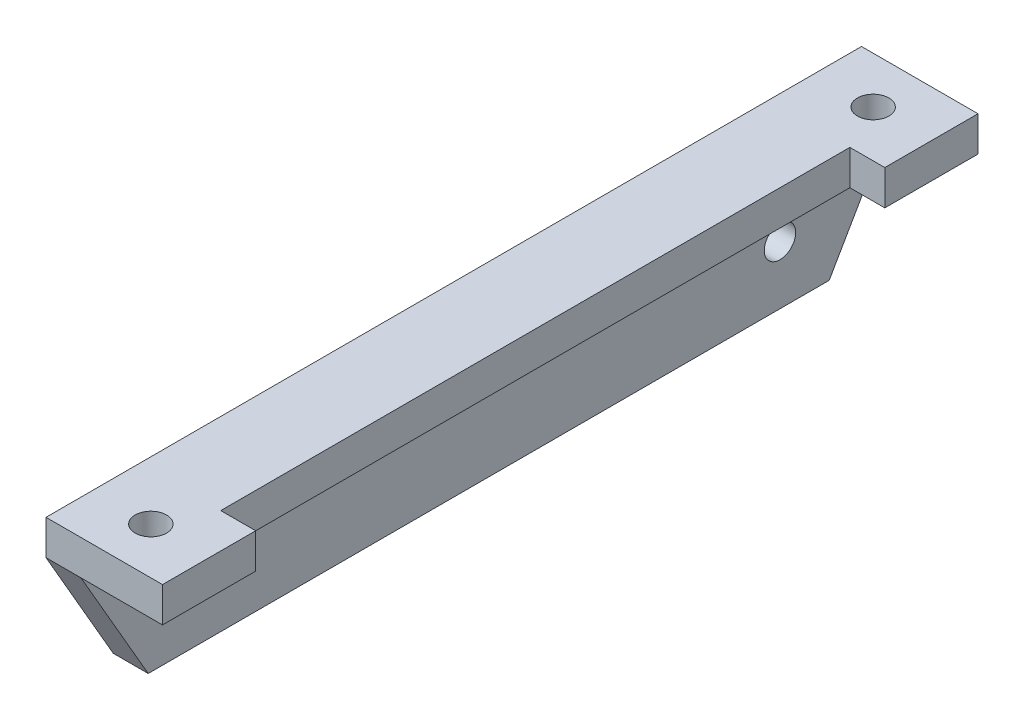
ISO-10303-21;
HEADER;
FILE_DESCRIPTION(('STEP AP214'),'2;1');
FILE_NAME('part.step','',(''),(''),'','','');
FILE_SCHEMA(('AUTOMOTIVE_DESIGN { 1 0 10303 214 1 1 1 1 }'));
ENDSEC;
DATA;
#1=APPLICATION_CONTEXT('core data for automotive mechanical design processes');
#2=APPLICATION_PROTOCOL_DEFINITION('international standard','automotive_design',2000,#1);
#3=PRODUCT_CONTEXT('',#1,'mechanical');
#4=PRODUCT('Part','Part','',(#3));
#5=PRODUCT_RELATED_PRODUCT_CATEGORY('part','',(#4));
#6=PRODUCT_DEFINITION_FORMATION('','',#4);
#7=PRODUCT_DEFINITION_CONTEXT('part definition',#1,'design');
#8=PRODUCT_DEFINITION('design','',#6,#7);
#9=PRODUCT_DEFINITION_SHAPE('','',#8);
#10=(LENGTH_UNIT() NAMED_UNIT(*) SI_UNIT(.MILLI.,.METRE.));
#11=(NAMED_UNIT(*) PLANE_ANGLE_UNIT() SI_UNIT($,.RADIAN.));
#12=(NAMED_UNIT(*) SI_UNIT($,.STERADIAN.) SOLID_ANGLE_UNIT());
#13=UNCERTAINTY_MEASURE_WITH_UNIT(LENGTH_MEASURE(1.E-05),#10,'distance_accuracy_value','');
#14=(GEOMETRIC_REPRESENTATION_CONTEXT(3) GLOBAL_UNCERTAINTY_ASSIGNED_CONTEXT((#13)) GLOBAL_UNIT_ASSIGNED_CONTEXT((#10,
#11,#12)) REPRESENTATION_CONTEXT('',''));
#15=CARTESIAN_POINT('',(0.,0.,0.));
#16=DIRECTION('',(0.,0.,1.));
#17=DIRECTION('',(1.,0.,0.));
#18=AXIS2_PLACEMENT_3D('',#15,#16,#17);
#19=CARTESIAN_POINT('',(10.,3.,35.));
#20=DIRECTION('',(-1.,0.,0.));
#21=DIRECTION('',(0.,0.,1.));
#22=AXIS2_PLACEMENT_3D('',#19,#20,#21);
#23=PLANE('',#22);
#24=DIRECTION('',(0.,0.,-1.));
#25=VECTOR('',#24,1.);
#26=CARTESIAN_POINT('',(10.,0.,35.));
#27=LINE('',#26,#25);
#28=CARTESIAN_POINT('',(10.,0.,35.));
#29=VERTEX_POINT('',#28);
#30=CARTESIAN_POINT('',(10.,0.,27.));
#31=VERTEX_POINT('',#30);
#32=EDGE_CURVE('E163',#29,#31,#27,.T.);
#33=ORIENTED_EDGE('',*,*,#32,.T.);
#34=DIRECTION('',(0.,1.,0.));
#35=VECTOR('',#34,1.);
#36=CARTESIAN_POINT('',(10.,-7.,27.));
#37=LINE('',#36,#35);
#38=CARTESIAN_POINT('',(10.,3.,27.));
#39=VERTEX_POINT('',#38);
#40=EDGE_CURVE('E259',#31,#39,#37,.T.);
#41=ORIENTED_EDGE('',*,*,#40,.T.);
#42=DIRECTION('',(0.,0.,-1.));
#43=VECTOR('',#42,1.);
#44=CARTESIAN_POINT('',(10.,3.,35.));
#45=LINE('',#44,#43);
#46=CARTESIAN_POINT('',(10.,3.,35.));
#47=VERTEX_POINT('',#46);
#48=EDGE_CURVE('E149',#47,#39,#45,.T.);
#49=ORIENTED_EDGE('',*,*,#48,.F.);
#50=DIRECTION('',(0.,-1.,0.));
#51=VECTOR('',#50,1.);
#52=CARTESIAN_POINT('',(10.,3.,35.));
#53=LINE('',#52,#51);
#54=EDGE_CURVE('E172',#47,#29,#53,.T.);
#55=ORIENTED_EDGE('',*,*,#54,.T.);
#56=EDGE_LOOP('',(#33,#41,#49,#55));
#57=FACE_BOUND('',#56,.T.);
#58=ADVANCED_FACE('F43',(#57),#23,.F.);
#59=CARTESIAN_POINT('',(0.,3.,35.));
#60=DIRECTION('',(1.,0.,0.));
#61=DIRECTION('',(0.,0.,-1.));
#62=AXIS2_PLACEMENT_3D('',#59,#60,#61);
#63=PLANE('',#62);
#64=CARTESIAN_POINT('',(0.,-5.,-25.));
#65=DIRECTION('',(1.,0.,0.));
#66=DIRECTION('',(0.,0.,-1.));
#67=AXIS2_PLACEMENT_3D('',#64,#65,#66);
#68=CIRCLE('',#67,1.35);
#69=CARTESIAN_POINT('',(0.,-5.,-26.35));
#70=VERTEX_POINT('',#69);
#71=EDGE_CURVE('E182',#70,#70,#68,.T.);
#72=ORIENTED_EDGE('',*,*,#71,.T.);
#73=EDGE_LOOP('',(#72));
#74=FACE_BOUND('',#73,.T.);
#75=CARTESIAN_POINT('',(0.,-5.,25.));
#76=DIRECTION('',(1.,0.,0.));
#77=DIRECTION('',(0.,0.,-1.));
#78=AXIS2_PLACEMENT_3D('',#75,#76,#77);
#79=CIRCLE('',#78,1.35);
#80=CARTESIAN_POINT('',(0.,-5.,23.65));
#81=VERTEX_POINT('',#80);
#82=EDGE_CURVE('E252',#81,#81,#79,.T.);
#83=ORIENTED_EDGE('',*,*,#82,.T.);
#84=EDGE_LOOP('',(#83));
#85=FACE_BOUND('',#84,.T.);
#86=DIRECTION('',(0.,-1.,0.));
#87=VECTOR('',#86,1.);
#88=CARTESIAN_POINT('',(0.,3.,-35.));
#89=LINE('',#88,#87);
#90=CARTESIAN_POINT('',(0.,3.,-35.));
#91=VERTEX_POINT('',#90);
#92=CARTESIAN_POINT('',(0.,0.,-35.));
#93=VERTEX_POINT('',#92);
#94=EDGE_CURVE('E158',#91,#93,#89,.T.);
#95=ORIENTED_EDGE('',*,*,#94,.T.);
#96=DIRECTION('',(0.,-0.86602540378444,0.499999999999998));
#97=VECTOR('',#96,1.);
#98=CARTESIAN_POINT('',(0.,-10.,-29.2264973081037));
#99=LINE('',#98,#97);
#100=CARTESIAN_POINT('',(0.,-10.,-29.2264973081037));
#101=VERTEX_POINT('',#100);
#102=EDGE_CURVE('E199',#93,#101,#99,.T.);
#103=ORIENTED_EDGE('',*,*,#102,.T.);
#104=DIRECTION('',(0.,0.,-1.));
#105=VECTOR('',#104,1.);
#106=CARTESIAN_POINT('',(0.,-10.,35.));
#107=LINE('',#106,#105);
#108=CARTESIAN_POINT('',(0.,-10.,29.2264973081037));
#109=VERTEX_POINT('',#108);
#110=EDGE_CURVE('E239',#109,#101,#107,.T.);
#111=ORIENTED_EDGE('',*,*,#110,.F.);
#112=DIRECTION('',(0.,0.86602540378444,0.499999999999998));
#113=VECTOR('',#112,1.);
#114=CARTESIAN_POINT('',(0.,-10.,29.2264973081037));
#115=LINE('',#114,#113);
#116=CARTESIAN_POINT('',(0.,0.,35.));
#117=VERTEX_POINT('',#116);
#118=EDGE_CURVE('E66',#109,#117,#115,.T.);
#119=ORIENTED_EDGE('',*,*,#118,.T.);
#120=DIRECTION('',(0.,-1.,0.));
#121=VECTOR('',#120,1.);
#122=CARTESIAN_POINT('',(0.,3.,35.));
#123=LINE('',#122,#121);
#124=CARTESIAN_POINT('',(0.,3.,35.));
#125=VERTEX_POINT('',#124);
#126=EDGE_CURVE('E175',#125,#117,#123,.T.);
#127=ORIENTED_EDGE('',*,*,#126,.F.);
#128=DIRECTION('',(0.,0.,1.));
#129=VECTOR('',#128,1.);
#130=CARTESIAN_POINT('',(0.,3.,35.));
#131=LINE('',#130,#129);
#132=EDGE_CURVE('E153',#91,#125,#131,.T.);
#133=ORIENTED_EDGE('',*,*,#132,.F.);
#134=EDGE_LOOP('',(#95,#103,#111,#119,#127,#133));
#135=FACE_BOUND('',#134,.T.);
#136=ADVANCED_FACE('F221',(#74,#85,#135),#63,.F.);
#137=CARTESIAN_POINT('',(0.,3.,35.));
#138=DIRECTION('',(0.,0.,-1.));
#139=DIRECTION('',(-1.,0.,0.));
#140=AXIS2_PLACEMENT_3D('',#137,#138,#139);
#141=PLANE('',#140);
#142=ORIENTED_EDGE('',*,*,#126,.T.);
#143=DIRECTION('',(1.,0.,0.));
#144=VECTOR('',#143,1.);
#145=CARTESIAN_POINT('',(3.,0.,35.));
#146=LINE('',#145,#144);
#147=CARTESIAN_POINT('',(3.,0.,35.));
#148=VERTEX_POINT('',#147);
#149=EDGE_CURVE('E201',#117,#148,#146,.T.);
#150=ORIENTED_EDGE('',*,*,#149,.T.);
#151=DIRECTION('',(1.,0.,0.));
#152=VECTOR('',#151,1.);
#153=CARTESIAN_POINT('',(0.,0.,35.));
#154=LINE('',#153,#152);
#155=EDGE_CURVE('E159',#148,#29,#154,.T.);
#156=ORIENTED_EDGE('',*,*,#155,.T.);
#157=ORIENTED_EDGE('',*,*,#54,.F.);
#158=DIRECTION('',(1.,0.,0.));
#159=VECTOR('',#158,1.);
#160=CARTESIAN_POINT('',(0.,3.,35.));
#161=LINE('',#160,#159);
#162=EDGE_CURVE('E150',#125,#47,#161,.T.);
#163=ORIENTED_EDGE('',*,*,#162,.F.);
#164=EDGE_LOOP('',(#142,#150,#156,#157,#163));
#165=FACE_BOUND('',#164,.T.);
#166=ADVANCED_FACE('F224',(#165),#141,.F.);
#167=CARTESIAN_POINT('',(10.,3.,-27.));
#168=VERTEX_POINT('',#167);
#169=CARTESIAN_POINT('',(9.99999999999999,3.,-35.));
#170=VERTEX_POINT('',#169);
#171=EDGE_CURVE('E139',#168,#170,#45,.T.);
#172=ORIENTED_EDGE('',*,*,#171,.F.);
#173=DIRECTION('',(0.,1.,0.));
#174=VECTOR('',#173,1.);
#175=CARTESIAN_POINT('',(10.,-7.,-27.));
#176=LINE('',#175,#174);
#177=CARTESIAN_POINT('',(10.,0.,-27.));
#178=VERTEX_POINT('',#177);
#179=EDGE_CURVE('E124',#178,#168,#176,.T.);
#180=ORIENTED_EDGE('',*,*,#179,.F.);
#181=CARTESIAN_POINT('',(9.99999999999999,0.,-35.));
#182=VERTEX_POINT('',#181);
#183=EDGE_CURVE('E161',#178,#182,#27,.T.);
#184=ORIENTED_EDGE('',*,*,#183,.T.);
#185=DIRECTION('',(0.,-1.,0.));
#186=VECTOR('',#185,1.);
#187=CARTESIAN_POINT('',(9.99999999999999,3.,-35.));
#188=LINE('',#187,#186);
#189=EDGE_CURVE('E147',#170,#182,#188,.T.);
#190=ORIENTED_EDGE('',*,*,#189,.F.);
#191=EDGE_LOOP('',(#172,#180,#184,#190));
#192=FACE_BOUND('',#191,.T.);
#193=ADVANCED_FACE('F145',(#192),#23,.F.);
#194=CARTESIAN_POINT('',(0.,3.,-35.));
#195=DIRECTION('',(0.,0.,1.));
#196=DIRECTION('',(1.,0.,0.));
#197=AXIS2_PLACEMENT_3D('',#194,#195,#196);
#198=PLANE('',#197);
#199=DIRECTION('',(-1.,0.,0.));
#200=VECTOR('',#199,1.);
#201=CARTESIAN_POINT('',(0.,0.,-35.));
#202=LINE('',#201,#200);
#203=CARTESIAN_POINT('',(3.,0.,-35.));
#204=VERTEX_POINT('',#203);
#205=EDGE_CURVE('E166',#182,#204,#202,.T.);
#206=ORIENTED_EDGE('',*,*,#205,.T.);
#207=DIRECTION('',(-1.,0.,0.));
#208=VECTOR('',#207,1.);
#209=CARTESIAN_POINT('',(0.,0.,-35.));
#210=LINE('',#209,#208);
#211=EDGE_CURVE('E196',#204,#93,#210,.T.);
#212=ORIENTED_EDGE('',*,*,#211,.T.);
#213=ORIENTED_EDGE('',*,*,#94,.F.);
#214=DIRECTION('',(-1.,0.,0.));
#215=VECTOR('',#214,1.);
#216=CARTESIAN_POINT('',(0.,3.,-35.));
#217=LINE('',#216,#215);
#218=EDGE_CURVE('E152',#170,#91,#217,.T.);
#219=ORIENTED_EDGE('',*,*,#218,.F.);
#220=ORIENTED_EDGE('',*,*,#189,.T.);
#221=EDGE_LOOP('',(#206,#212,#213,#219,#220));
#222=FACE_BOUND('',#221,.T.);
#223=ADVANCED_FACE('F215',(#222),#198,.F.);
#224=CARTESIAN_POINT('',(0.,3.,0.));
#225=DIRECTION('',(0.,-1.,0.));
#226=DIRECTION('',(0.,0.,-1.));
#227=AXIS2_PLACEMENT_3D('',#224,#225,#226);
#228=PLANE('',#227);
#229=CARTESIAN_POINT('',(4.99999999999999,3.,-31.));
#230=DIRECTION('',(0.,-1.,0.));
#231=DIRECTION('',(0.,0.,-1.));
#232=AXIS2_PLACEMENT_3D('',#229,#230,#231);
#233=CIRCLE('',#232,1.35);
#234=CARTESIAN_POINT('',(4.99999999999999,3.,-32.35));
#235=VERTEX_POINT('',#234);
#236=EDGE_CURVE('E186',#235,#235,#233,.T.);
#237=ORIENTED_EDGE('',*,*,#236,.T.);
#238=EDGE_LOOP('',(#237));
#239=FACE_BOUND('',#238,.T.);
#240=CARTESIAN_POINT('',(4.99999999999998,3.,31.));
#241=DIRECTION('',(0.,-1.,0.));
#242=DIRECTION('',(0.,0.,-1.));
#243=AXIS2_PLACEMENT_3D('',#240,#241,#242);
#244=CIRCLE('',#243,1.35);
#245=CARTESIAN_POINT('',(4.99999999999998,3.,29.65));
#246=VERTEX_POINT('',#245);
#247=EDGE_CURVE('E181',#246,#246,#244,.T.);
#248=ORIENTED_EDGE('',*,*,#247,.T.);
#249=EDGE_LOOP('',(#248));
#250=FACE_BOUND('',#249,.T.);
#251=ORIENTED_EDGE('',*,*,#48,.T.);
#252=DIRECTION('',(1.,0.,0.));
#253=VECTOR('',#252,1.);
#254=CARTESIAN_POINT('',(10.,3.,27.));
#255=LINE('',#254,#253);
#256=CARTESIAN_POINT('',(7.00000000000001,3.,27.));
#257=VERTEX_POINT('',#256);
#258=EDGE_CURVE('E134',#257,#39,#255,.T.);
#259=ORIENTED_EDGE('',*,*,#258,.F.);
#260=DIRECTION('',(0.,0.,1.));
#261=VECTOR('',#260,1.);
#262=CARTESIAN_POINT('',(7.,3.,-27.));
#263=LINE('',#262,#261);
#264=CARTESIAN_POINT('',(7.,3.,-27.));
#265=VERTEX_POINT('',#264);
#266=EDGE_CURVE('E143',#265,#257,#263,.T.);
#267=ORIENTED_EDGE('',*,*,#266,.F.);
#268=DIRECTION('',(-1.,0.,0.));
#269=VECTOR('',#268,1.);
#270=CARTESIAN_POINT('',(10.,3.,-27.));
#271=LINE('',#270,#269);
#272=EDGE_CURVE('E127',#168,#265,#271,.T.);
#273=ORIENTED_EDGE('',*,*,#272,.F.);
#274=ORIENTED_EDGE('',*,*,#171,.T.);
#275=ORIENTED_EDGE('',*,*,#218,.T.);
#276=ORIENTED_EDGE('',*,*,#132,.T.);
#277=ORIENTED_EDGE('',*,*,#162,.T.);
#278=EDGE_LOOP('',(#251,#259,#267,#273,#274,#275,#276,#277));
#279=FACE_BOUND('',#278,.T.);
#280=ADVANCED_FACE('F138',(#239,#250,#279),#228,.F.);
#281=CARTESIAN_POINT('',(0.,0.,0.));
#282=DIRECTION('',(0.,-1.,0.));
#283=DIRECTION('',(0.,0.,-1.));
#284=AXIS2_PLACEMENT_3D('',#281,#282,#283);
#285=PLANE('',#284);
#286=DIRECTION('',(-1.,0.,0.));
#287=VECTOR('',#286,1.);
#288=CARTESIAN_POINT('',(0.,0.,27.));
#289=LINE('',#288,#287);
#290=CARTESIAN_POINT('',(7.00000000000001,0.,27.));
#291=VERTEX_POINT('',#290);
#292=EDGE_CURVE('E11',#31,#291,#289,.T.);
#293=ORIENTED_EDGE('',*,*,#292,.F.);
#294=ORIENTED_EDGE('',*,*,#32,.F.);
#295=ORIENTED_EDGE('',*,*,#155,.F.);
#296=DIRECTION('',(0.,0.,1.));
#297=VECTOR('',#296,1.);
#298=CARTESIAN_POINT('',(3.,0.,35.));
#299=LINE('',#298,#297);
#300=EDGE_CURVE('E234',#204,#148,#299,.T.);
#301=ORIENTED_EDGE('',*,*,#300,.F.);
#302=ORIENTED_EDGE('',*,*,#205,.F.);
#303=ORIENTED_EDGE('',*,*,#183,.F.);
#304=DIRECTION('',(1.,0.,0.));
#305=VECTOR('',#304,1.);
#306=CARTESIAN_POINT('',(0.,0.,-27.));
#307=LINE('',#306,#305);
#308=CARTESIAN_POINT('',(7.,0.,-27.));
#309=VERTEX_POINT('',#308);
#310=EDGE_CURVE('E130',#309,#178,#307,.T.);
#311=ORIENTED_EDGE('',*,*,#310,.F.);
#312=DIRECTION('',(0.,0.,-1.));
#313=VECTOR('',#312,1.);
#314=CARTESIAN_POINT('',(7.,0.,0.));
#315=LINE('',#314,#313);
#316=EDGE_CURVE('E51',#291,#309,#315,.T.);
#317=ORIENTED_EDGE('',*,*,#316,.F.);
#318=EDGE_LOOP('',(#293,#294,#295,#301,#302,#303,#311,#317));
#319=FACE_BOUND('',#318,.T.);
#320=CARTESIAN_POINT('',(4.99999999999999,0.,-31.));
#321=DIRECTION('',(0.,-1.,0.));
#322=DIRECTION('',(0.,0.,-1.));
#323=AXIS2_PLACEMENT_3D('',#320,#321,#322);
#324=CIRCLE('',#323,1.35);
#325=CARTESIAN_POINT('',(4.99999999999999,0.,-32.35));
#326=VERTEX_POINT('',#325);
#327=EDGE_CURVE('E183',#326,#326,#324,.T.);
#328=ORIENTED_EDGE('',*,*,#327,.F.);
#329=EDGE_LOOP('',(#328));
#330=FACE_BOUND('',#329,.T.);
#331=CARTESIAN_POINT('',(4.99999999999998,0.,31.));
#332=DIRECTION('',(0.,-1.,0.));
#333=DIRECTION('',(0.,0.,-1.));
#334=AXIS2_PLACEMENT_3D('',#331,#332,#333);
#335=CIRCLE('',#334,1.35);
#336=CARTESIAN_POINT('',(4.99999999999998,0.,29.65));
#337=VERTEX_POINT('',#336);
#338=EDGE_CURVE('E178',#337,#337,#335,.T.);
#339=ORIENTED_EDGE('',*,*,#338,.F.);
#340=EDGE_LOOP('',(#339));
#341=FACE_BOUND('',#340,.T.);
#342=ADVANCED_FACE('F210',(#319,#330,#341),#285,.T.);
#343=CARTESIAN_POINT('',(3.,-10.,35.));
#344=DIRECTION('',(-1.,0.,0.));
#345=DIRECTION('',(0.,0.,1.));
#346=AXIS2_PLACEMENT_3D('',#343,#344,#345);
#347=PLANE('',#346);
#348=CARTESIAN_POINT('',(3.00000000000001,-5.,-25.));
#349=DIRECTION('',(1.,0.,0.));
#350=DIRECTION('',(0.,0.,-1.));
#351=AXIS2_PLACEMENT_3D('',#348,#349,#350);
#352=CIRCLE('',#351,1.35);
#353=CARTESIAN_POINT('',(3.00000000000001,-5.,-26.35));
#354=VERTEX_POINT('',#353);
#355=EDGE_CURVE('E255',#354,#354,#352,.T.);
#356=ORIENTED_EDGE('',*,*,#355,.F.);
#357=EDGE_LOOP('',(#356));
#358=FACE_BOUND('',#357,.T.);
#359=CARTESIAN_POINT('',(3.,-5.,25.));
#360=DIRECTION('',(1.,0.,0.));
#361=DIRECTION('',(0.,0.,-1.));
#362=AXIS2_PLACEMENT_3D('',#359,#360,#361);
#363=CIRCLE('',#362,1.35);
#364=CARTESIAN_POINT('',(3.,-5.,23.65));
#365=VERTEX_POINT('',#364);
#366=EDGE_CURVE('E256',#365,#365,#363,.T.);
#367=ORIENTED_EDGE('',*,*,#366,.F.);
#368=EDGE_LOOP('',(#367));
#369=FACE_BOUND('',#368,.T.);
#370=DIRECTION('',(0.,0.,1.));
#371=VECTOR('',#370,1.);
#372=CARTESIAN_POINT('',(3.,-10.,35.));
#373=LINE('',#372,#371);
#374=CARTESIAN_POINT('',(3.00000000000001,-10.,-29.2264973081037));
#375=VERTEX_POINT('',#374);
#376=CARTESIAN_POINT('',(3.,-10.,29.2264973081037));
#377=VERTEX_POINT('',#376);
#378=EDGE_CURVE('E162',#375,#377,#373,.T.);
#379=ORIENTED_EDGE('',*,*,#378,.F.);
#380=DIRECTION('',(0.,0.86602540378444,-0.499999999999998));
#381=VECTOR('',#380,1.);
#382=CARTESIAN_POINT('',(3.00000000000001,-10.,-29.2264973081037));
#383=LINE('',#382,#381);
#384=EDGE_CURVE('E194',#375,#204,#383,.T.);
#385=ORIENTED_EDGE('',*,*,#384,.T.);
#386=ORIENTED_EDGE('',*,*,#300,.T.);
#387=DIRECTION('',(0.,-0.86602540378444,-0.499999999999998));
#388=VECTOR('',#387,1.);
#389=CARTESIAN_POINT('',(3.,-10.,29.2264973081037));
#390=LINE('',#389,#388);
#391=EDGE_CURVE('E192',#148,#377,#390,.T.);
#392=ORIENTED_EDGE('',*,*,#391,.T.);
#393=EDGE_LOOP('',(#379,#385,#386,#392));
#394=FACE_BOUND('',#393,.T.);
#395=ADVANCED_FACE('F233',(#358,#369,#394),#347,.F.);
#396=CARTESIAN_POINT('',(0.,-10.,0.));
#397=DIRECTION('',(0.,-1.,0.));
#398=DIRECTION('',(0.,0.,-1.));
#399=AXIS2_PLACEMENT_3D('',#396,#397,#398);
#400=PLANE('',#399);
#401=ORIENTED_EDGE('',*,*,#110,.T.);
#402=DIRECTION('',(1.,0.,0.));
#403=VECTOR('',#402,1.);
#404=CARTESIAN_POINT('',(3.00000000000001,-10.,-29.2264973081037));
#405=LINE('',#404,#403);
#406=EDGE_CURVE('E189',#101,#375,#405,.T.);
#407=ORIENTED_EDGE('',*,*,#406,.T.);
#408=ORIENTED_EDGE('',*,*,#378,.T.);
#409=DIRECTION('',(-1.,0.,0.));
#410=VECTOR('',#409,1.);
#411=CARTESIAN_POINT('',(0.,-10.,29.2264973081037));
#412=LINE('',#411,#410);
#413=EDGE_CURVE('E177',#377,#109,#412,.T.);
#414=ORIENTED_EDGE('',*,*,#413,.T.);
#415=EDGE_LOOP('',(#401,#407,#408,#414));
#416=FACE_BOUND('',#415,.T.);
#417=ADVANCED_FACE('F237',(#416),#400,.T.);
#418=CARTESIAN_POINT('',(4.99999999999998,-10.,31.));
#419=DIRECTION('',(0.,1.,0.));
#420=DIRECTION('',(0.,0.,1.));
#421=AXIS2_PLACEMENT_3D('',#418,#419,#420);
#422=CYLINDRICAL_SURFACE('',#421,1.35);
#423=ORIENTED_EDGE('',*,*,#338,.T.);
#424=EDGE_LOOP('',(#423));
#425=FACE_BOUND('',#424,.T.);
#426=ORIENTED_EDGE('',*,*,#247,.F.);
#427=EDGE_LOOP('',(#426));
#428=FACE_BOUND('',#427,.T.);
#429=ADVANCED_FACE('F315',(#425,#428),#422,.F.);
#430=CARTESIAN_POINT('',(4.99999999999999,-10.,-31.));
#431=DIRECTION('',(0.,1.,0.));
#432=DIRECTION('',(0.,0.,1.));
#433=AXIS2_PLACEMENT_3D('',#430,#431,#432);
#434=CYLINDRICAL_SURFACE('',#433,1.35);
#435=ORIENTED_EDGE('',*,*,#327,.T.);
#436=EDGE_LOOP('',(#435));
#437=FACE_BOUND('',#436,.T.);
#438=ORIENTED_EDGE('',*,*,#236,.F.);
#439=EDGE_LOOP('',(#438));
#440=FACE_BOUND('',#439,.T.);
#441=ADVANCED_FACE('F306',(#437,#440),#434,.F.);
#442=CARTESIAN_POINT('',(-7.,-5.,25.));
#443=DIRECTION('',(1.,0.,0.));
#444=DIRECTION('',(0.,0.,-1.));
#445=AXIS2_PLACEMENT_3D('',#442,#443,#444);
#446=CYLINDRICAL_SURFACE('',#445,1.35);
#447=ORIENTED_EDGE('',*,*,#366,.T.);
#448=EDGE_LOOP('',(#447));
#449=FACE_BOUND('',#448,.T.);
#450=ORIENTED_EDGE('',*,*,#82,.F.);
#451=EDGE_LOOP('',(#450));
#452=FACE_BOUND('',#451,.T.);
#453=ADVANCED_FACE('F299',(#449,#452),#446,.F.);
#454=CARTESIAN_POINT('',(-6.99999999999999,-5.,-25.));
#455=DIRECTION('',(1.,0.,0.));
#456=DIRECTION('',(0.,0.,-1.));
#457=AXIS2_PLACEMENT_3D('',#454,#455,#456);
#458=CYLINDRICAL_SURFACE('',#457,1.35);
#459=ORIENTED_EDGE('',*,*,#355,.T.);
#460=EDGE_LOOP('',(#459));
#461=FACE_BOUND('',#460,.T.);
#462=ORIENTED_EDGE('',*,*,#71,.F.);
#463=EDGE_LOOP('',(#462));
#464=FACE_BOUND('',#463,.T.);
#465=ADVANCED_FACE('F292',(#461,#464),#458,.F.);
#466=CARTESIAN_POINT('',(0.,-10.,-29.2264973081037));
#467=DIRECTION('',(0.,-0.499999999999998,-0.86602540378444));
#468=DIRECTION('',(-1.,0.,0.));
#469=AXIS2_PLACEMENT_3D('',#466,#467,#468);
#470=PLANE('',#469);
#471=ORIENTED_EDGE('',*,*,#102,.F.);
#472=ORIENTED_EDGE('',*,*,#211,.F.);
#473=ORIENTED_EDGE('',*,*,#384,.F.);
#474=ORIENTED_EDGE('',*,*,#406,.F.);
#475=EDGE_LOOP('',(#471,#472,#473,#474));
#476=FACE_BOUND('',#475,.T.);
#477=ADVANCED_FACE('F290',(#476),#470,.T.);
#478=CARTESIAN_POINT('',(0.,-10.,29.2264973081037));
#479=DIRECTION('',(0.,-0.499999999999998,0.86602540378444));
#480=DIRECTION('',(1.,0.,0.));
#481=AXIS2_PLACEMENT_3D('',#478,#479,#480);
#482=PLANE('',#481);
#483=ORIENTED_EDGE('',*,*,#391,.F.);
#484=ORIENTED_EDGE('',*,*,#149,.F.);
#485=ORIENTED_EDGE('',*,*,#118,.F.);
#486=ORIENTED_EDGE('',*,*,#413,.F.);
#487=EDGE_LOOP('',(#483,#484,#485,#486));
#488=FACE_BOUND('',#487,.T.);
#489=ADVANCED_FACE('F45',(#488),#482,.T.);
#490=CARTESIAN_POINT('',(10.,-7.,27.));
#491=DIRECTION('',(0.,0.,1.));
#492=DIRECTION('',(1.,0.,0.));
#493=AXIS2_PLACEMENT_3D('',#490,#491,#492);
#494=PLANE('',#493);
#495=ORIENTED_EDGE('',*,*,#292,.T.);
#496=DIRECTION('',(0.,1.,0.));
#497=VECTOR('',#496,1.);
#498=CARTESIAN_POINT('',(7.00000000000001,-7.,27.));
#499=LINE('',#498,#497);
#500=EDGE_CURVE('E207',#291,#257,#499,.T.);
#501=ORIENTED_EDGE('',*,*,#500,.T.);
#502=ORIENTED_EDGE('',*,*,#258,.T.);
#503=ORIENTED_EDGE('',*,*,#40,.F.);
#504=EDGE_LOOP('',(#495,#501,#502,#503));
#505=FACE_BOUND('',#504,.T.);
#506=ADVANCED_FACE('F269',(#505),#494,.F.);
#507=CARTESIAN_POINT('',(7.,-7.,-27.));
#508=DIRECTION('',(-1.,0.,0.));
#509=DIRECTION('',(0.,0.,1.));
#510=AXIS2_PLACEMENT_3D('',#507,#508,#509);
#511=PLANE('',#510);
#512=ORIENTED_EDGE('',*,*,#316,.T.);
#513=DIRECTION('',(0.,1.,0.));
#514=VECTOR('',#513,1.);
#515=CARTESIAN_POINT('',(7.,-7.,-27.));
#516=LINE('',#515,#514);
#517=EDGE_CURVE('E58',#309,#265,#516,.T.);
#518=ORIENTED_EDGE('',*,*,#517,.T.);
#519=ORIENTED_EDGE('',*,*,#266,.T.);
#520=ORIENTED_EDGE('',*,*,#500,.F.);
#521=EDGE_LOOP('',(#512,#518,#519,#520));
#522=FACE_BOUND('',#521,.T.);
#523=ADVANCED_FACE('F206',(#522),#511,.F.);
#524=CARTESIAN_POINT('',(10.,-7.,-27.));
#525=DIRECTION('',(0.,0.,-1.));
#526=DIRECTION('',(-1.,0.,0.));
#527=AXIS2_PLACEMENT_3D('',#524,#525,#526);
#528=PLANE('',#527);
#529=ORIENTED_EDGE('',*,*,#310,.T.);
#530=ORIENTED_EDGE('',*,*,#179,.T.);
#531=ORIENTED_EDGE('',*,*,#272,.T.);
#532=ORIENTED_EDGE('',*,*,#517,.F.);
#533=EDGE_LOOP('',(#529,#530,#531,#532));
#534=FACE_BOUND('',#533,.T.);
#535=ADVANCED_FACE('F126',(#534),#528,.F.);
#536=CLOSED_SHELL('',(#58,#136,#166,#193,#223,#280,#342,#395,#417,#429,#441,#453,#465,#477,#489,
#506,#523,#535));
#537=MANIFOLD_SOLID_BREP('B2',#536);
#538=ADVANCED_BREP_SHAPE_REPRESENTATION('',(#18,#537),#14);
#539=SHAPE_DEFINITION_REPRESENTATION(#9,#538);
ENDSEC;
END-ISO-10303-21;
